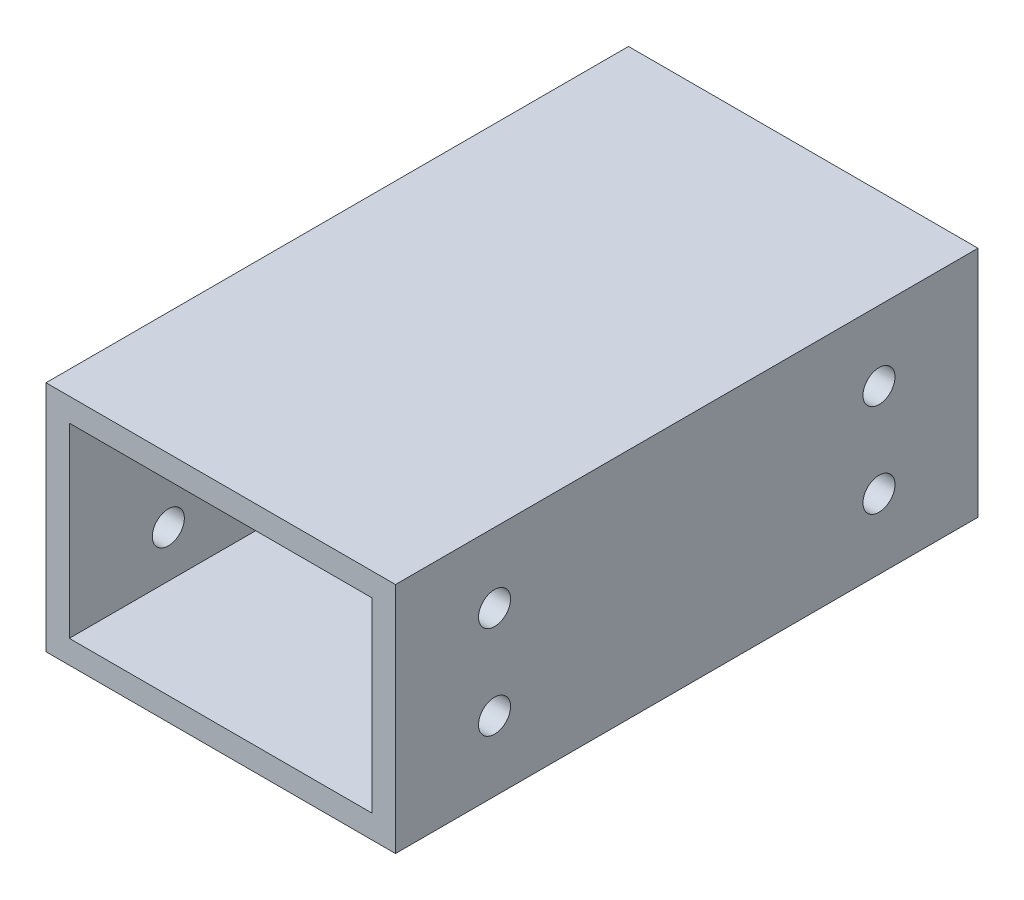
ISO-10303-21;
HEADER;
FILE_DESCRIPTION(('STEP AP214'),'2;1');
FILE_NAME('part.step','',(''),(''),'','','');
FILE_SCHEMA(('AUTOMOTIVE_DESIGN { 1 0 10303 214 1 1 1 1 }'));
ENDSEC;
DATA;
#1=APPLICATION_CONTEXT('core data for automotive mechanical design processes');
#2=APPLICATION_PROTOCOL_DEFINITION('international standard','automotive_design',2000,#1);
#3=PRODUCT_CONTEXT('',#1,'mechanical');
#4=PRODUCT('Part','Part','',(#3));
#5=PRODUCT_RELATED_PRODUCT_CATEGORY('part','',(#4));
#6=PRODUCT_DEFINITION_FORMATION('','',#4);
#7=PRODUCT_DEFINITION_CONTEXT('part definition',#1,'design');
#8=PRODUCT_DEFINITION('design','',#6,#7);
#9=PRODUCT_DEFINITION_SHAPE('','',#8);
#10=(LENGTH_UNIT() NAMED_UNIT(*) SI_UNIT(.MILLI.,.METRE.));
#11=(NAMED_UNIT(*) PLANE_ANGLE_UNIT() SI_UNIT($,.RADIAN.));
#12=(NAMED_UNIT(*) SI_UNIT($,.STERADIAN.) SOLID_ANGLE_UNIT());
#13=UNCERTAINTY_MEASURE_WITH_UNIT(LENGTH_MEASURE(1.E-05),#10,'distance_accuracy_value','');
#14=(GEOMETRIC_REPRESENTATION_CONTEXT(3) GLOBAL_UNCERTAINTY_ASSIGNED_CONTEXT((#13)) GLOBAL_UNIT_ASSIGNED_CONTEXT((#10,
#11,#12)) REPRESENTATION_CONTEXT('',''));
#15=CARTESIAN_POINT('',(0.,0.,0.));
#16=DIRECTION('',(0.,0.,1.));
#17=DIRECTION('',(1.,0.,0.));
#18=AXIS2_PLACEMENT_3D('',#15,#16,#17);
#19=CARTESIAN_POINT('',(30.,-20.,-50.));
#20=DIRECTION('',(1.,0.,0.));
#21=DIRECTION('',(0.,0.,-1.));
#22=AXIS2_PLACEMENT_3D('',#19,#20,#21);
#23=PLANE('',#22);
#24=CARTESIAN_POINT('',(30.,8.,-33.));
#25=DIRECTION('',(-1.,0.,0.));
#26=DIRECTION('',(0.,0.,1.));
#27=AXIS2_PLACEMENT_3D('',#24,#25,#26);
#28=CIRCLE('',#27,2.74999999999999);
#29=CARTESIAN_POINT('',(30.,8.,-30.25));
#30=VERTEX_POINT('',#29);
#31=EDGE_CURVE('E237',#30,#30,#28,.T.);
#32=ORIENTED_EDGE('',*,*,#31,.T.);
#33=EDGE_LOOP('',(#32));
#34=FACE_BOUND('',#33,.T.);
#35=CARTESIAN_POINT('',(30.,-8.,-33.));
#36=DIRECTION('',(-1.,0.,0.));
#37=DIRECTION('',(0.,0.,1.));
#38=AXIS2_PLACEMENT_3D('',#35,#36,#37);
#39=CIRCLE('',#38,2.74999999999999);
#40=CARTESIAN_POINT('',(30.,-8.,-30.25));
#41=VERTEX_POINT('',#40);
#42=EDGE_CURVE('E180',#41,#41,#39,.T.);
#43=ORIENTED_EDGE('',*,*,#42,.T.);
#44=EDGE_LOOP('',(#43));
#45=FACE_BOUND('',#44,.T.);
#46=CARTESIAN_POINT('',(30.,8.,33.));
#47=DIRECTION('',(-1.,0.,0.));
#48=DIRECTION('',(0.,0.,1.));
#49=AXIS2_PLACEMENT_3D('',#46,#47,#48);
#50=CIRCLE('',#49,2.74999999999999);
#51=CARTESIAN_POINT('',(30.,8.,35.75));
#52=VERTEX_POINT('',#51);
#53=EDGE_CURVE('E176',#52,#52,#50,.T.);
#54=ORIENTED_EDGE('',*,*,#53,.T.);
#55=EDGE_LOOP('',(#54));
#56=FACE_BOUND('',#55,.T.);
#57=CARTESIAN_POINT('',(30.,-8.,33.));
#58=DIRECTION('',(-1.,0.,0.));
#59=DIRECTION('',(0.,0.,1.));
#60=AXIS2_PLACEMENT_3D('',#57,#58,#59);
#61=CIRCLE('',#60,2.74999999999999);
#62=CARTESIAN_POINT('',(30.,-8.,35.75));
#63=VERTEX_POINT('',#62);
#64=EDGE_CURVE('E172',#63,#63,#61,.T.);
#65=ORIENTED_EDGE('',*,*,#64,.T.);
#66=EDGE_LOOP('',(#65));
#67=FACE_BOUND('',#66,.T.);
#68=DIRECTION('',(0.,0.,1.));
#69=VECTOR('',#68,1.);
#70=CARTESIAN_POINT('',(30.,20.,-50.));
#71=LINE('',#70,#69);
#72=CARTESIAN_POINT('',(30.,20.,-50.));
#73=VERTEX_POINT('',#72);
#74=CARTESIAN_POINT('',(30.,20.,50.));
#75=VERTEX_POINT('',#74);
#76=EDGE_CURVE('E163',#73,#75,#71,.T.);
#77=ORIENTED_EDGE('',*,*,#76,.T.);
#78=DIRECTION('',(0.,1.,0.));
#79=VECTOR('',#78,1.);
#80=CARTESIAN_POINT('',(30.,-20.,50.));
#81=LINE('',#80,#79);
#82=CARTESIAN_POINT('',(30.,-20.,50.));
#83=VERTEX_POINT('',#82);
#84=EDGE_CURVE('E131',#83,#75,#81,.T.);
#85=ORIENTED_EDGE('',*,*,#84,.F.);
#86=DIRECTION('',(0.,0.,1.));
#87=VECTOR('',#86,1.);
#88=CARTESIAN_POINT('',(30.,-20.,-50.));
#89=LINE('',#88,#87);
#90=CARTESIAN_POINT('',(30.,-20.,-50.));
#91=VERTEX_POINT('',#90);
#92=EDGE_CURVE('E11',#91,#83,#89,.T.);
#93=ORIENTED_EDGE('',*,*,#92,.F.);
#94=DIRECTION('',(0.,1.,0.));
#95=VECTOR('',#94,1.);
#96=CARTESIAN_POINT('',(30.,-20.,-50.));
#97=LINE('',#96,#95);
#98=EDGE_CURVE('E150',#91,#73,#97,.T.);
#99=ORIENTED_EDGE('',*,*,#98,.T.);
#100=EDGE_LOOP('',(#77,#85,#93,#99));
#101=FACE_BOUND('',#100,.T.);
#102=ADVANCED_FACE('F34',(#34,#45,#56,#67,#101),#23,.T.);
#103=CARTESIAN_POINT('',(-30.,-20.,-50.));
#104=DIRECTION('',(0.,-1.,0.));
#105=DIRECTION('',(0.,0.,-1.));
#106=AXIS2_PLACEMENT_3D('',#103,#104,#105);
#107=PLANE('',#106);
#108=ORIENTED_EDGE('',*,*,#92,.T.);
#109=DIRECTION('',(1.,0.,0.));
#110=VECTOR('',#109,1.);
#111=CARTESIAN_POINT('',(-30.,-20.,50.));
#112=LINE('',#111,#110);
#113=CARTESIAN_POINT('',(-30.,-20.,50.));
#114=VERTEX_POINT('',#113);
#115=EDGE_CURVE('E140',#114,#83,#112,.T.);
#116=ORIENTED_EDGE('',*,*,#115,.F.);
#117=DIRECTION('',(0.,0.,1.));
#118=VECTOR('',#117,1.);
#119=CARTESIAN_POINT('',(-30.,-20.,-50.));
#120=LINE('',#119,#118);
#121=CARTESIAN_POINT('',(-30.,-20.,-50.));
#122=VERTEX_POINT('',#121);
#123=EDGE_CURVE('E42',#122,#114,#120,.T.);
#124=ORIENTED_EDGE('',*,*,#123,.F.);
#125=DIRECTION('',(1.,0.,0.));
#126=VECTOR('',#125,1.);
#127=CARTESIAN_POINT('',(-30.,-20.,-50.));
#128=LINE('',#127,#126);
#129=EDGE_CURVE('E161',#122,#91,#128,.T.);
#130=ORIENTED_EDGE('',*,*,#129,.T.);
#131=EDGE_LOOP('',(#108,#116,#124,#130));
#132=FACE_BOUND('',#131,.T.);
#133=ADVANCED_FACE('F227',(#132),#107,.T.);
#134=CARTESIAN_POINT('',(-30.,-20.,-50.));
#135=DIRECTION('',(-1.,0.,0.));
#136=DIRECTION('',(0.,0.,1.));
#137=AXIS2_PLACEMENT_3D('',#134,#135,#136);
#138=PLANE('',#137);
#139=CARTESIAN_POINT('',(-30.,8.,-33.));
#140=DIRECTION('',(-1.,0.,0.));
#141=DIRECTION('',(0.,0.,1.));
#142=AXIS2_PLACEMENT_3D('',#139,#140,#141);
#143=CIRCLE('',#142,2.74999999999999);
#144=CARTESIAN_POINT('',(-30.,8.,-30.25));
#145=VERTEX_POINT('',#144);
#146=EDGE_CURVE('E356',#145,#145,#143,.T.);
#147=ORIENTED_EDGE('',*,*,#146,.F.);
#148=EDGE_LOOP('',(#147));
#149=FACE_BOUND('',#148,.T.);
#150=CARTESIAN_POINT('',(-30.,-8.,-33.));
#151=DIRECTION('',(-1.,0.,0.));
#152=DIRECTION('',(0.,0.,1.));
#153=AXIS2_PLACEMENT_3D('',#150,#151,#152);
#154=CIRCLE('',#153,2.74999999999999);
#155=CARTESIAN_POINT('',(-30.,-8.,-30.25));
#156=VERTEX_POINT('',#155);
#157=EDGE_CURVE('E187',#156,#156,#154,.T.);
#158=ORIENTED_EDGE('',*,*,#157,.F.);
#159=EDGE_LOOP('',(#158));
#160=FACE_BOUND('',#159,.T.);
#161=CARTESIAN_POINT('',(-30.,8.,33.));
#162=DIRECTION('',(-1.,0.,0.));
#163=DIRECTION('',(0.,0.,1.));
#164=AXIS2_PLACEMENT_3D('',#161,#162,#163);
#165=CIRCLE('',#164,2.74999999999999);
#166=CARTESIAN_POINT('',(-30.,8.,35.75));
#167=VERTEX_POINT('',#166);
#168=EDGE_CURVE('E184',#167,#167,#165,.T.);
#169=ORIENTED_EDGE('',*,*,#168,.F.);
#170=EDGE_LOOP('',(#169));
#171=FACE_BOUND('',#170,.T.);
#172=CARTESIAN_POINT('',(-30.,-8.,33.));
#173=DIRECTION('',(-1.,0.,0.));
#174=DIRECTION('',(0.,0.,1.));
#175=AXIS2_PLACEMENT_3D('',#172,#173,#174);
#176=CIRCLE('',#175,2.74999999999999);
#177=CARTESIAN_POINT('',(-30.,-8.,35.75));
#178=VERTEX_POINT('',#177);
#179=EDGE_CURVE('E202',#178,#178,#176,.T.);
#180=ORIENTED_EDGE('',*,*,#179,.F.);
#181=EDGE_LOOP('',(#180));
#182=FACE_BOUND('',#181,.T.);
#183=ORIENTED_EDGE('',*,*,#123,.T.);
#184=DIRECTION('',(0.,-1.,0.));
#185=VECTOR('',#184,1.);
#186=CARTESIAN_POINT('',(-30.,-20.,50.));
#187=LINE('',#186,#185);
#188=CARTESIAN_POINT('',(-30.,20.,50.));
#189=VERTEX_POINT('',#188);
#190=EDGE_CURVE('E137',#189,#114,#187,.T.);
#191=ORIENTED_EDGE('',*,*,#190,.F.);
#192=DIRECTION('',(0.,0.,1.));
#193=VECTOR('',#192,1.);
#194=CARTESIAN_POINT('',(-30.,20.,-50.));
#195=LINE('',#194,#193);
#196=CARTESIAN_POINT('',(-30.,20.,-50.));
#197=VERTEX_POINT('',#196);
#198=EDGE_CURVE('E166',#197,#189,#195,.T.);
#199=ORIENTED_EDGE('',*,*,#198,.F.);
#200=DIRECTION('',(0.,-1.,0.));
#201=VECTOR('',#200,1.);
#202=CARTESIAN_POINT('',(-30.,-20.,-50.));
#203=LINE('',#202,#201);
#204=EDGE_CURVE('E158',#197,#122,#203,.T.);
#205=ORIENTED_EDGE('',*,*,#204,.T.);
#206=EDGE_LOOP('',(#183,#191,#199,#205));
#207=FACE_BOUND('',#206,.T.);
#208=ADVANCED_FACE('F232',(#149,#160,#171,#182,#207),#138,.T.);
#209=CARTESIAN_POINT('',(-30.,20.,-50.));
#210=DIRECTION('',(0.,1.,0.));
#211=DIRECTION('',(0.,0.,1.));
#212=AXIS2_PLACEMENT_3D('',#209,#210,#211);
#213=PLANE('',#212);
#214=ORIENTED_EDGE('',*,*,#198,.T.);
#215=DIRECTION('',(-1.,0.,0.));
#216=VECTOR('',#215,1.);
#217=CARTESIAN_POINT('',(-30.,20.,50.));
#218=LINE('',#217,#216);
#219=EDGE_CURVE('E134',#75,#189,#218,.T.);
#220=ORIENTED_EDGE('',*,*,#219,.F.);
#221=ORIENTED_EDGE('',*,*,#76,.F.);
#222=DIRECTION('',(-1.,0.,0.));
#223=VECTOR('',#222,1.);
#224=CARTESIAN_POINT('',(-30.,20.,-50.));
#225=LINE('',#224,#223);
#226=EDGE_CURVE('E155',#73,#197,#225,.T.);
#227=ORIENTED_EDGE('',*,*,#226,.T.);
#228=EDGE_LOOP('',(#214,#220,#221,#227));
#229=FACE_BOUND('',#228,.T.);
#230=ADVANCED_FACE('F244',(#229),#213,.T.);
#231=CARTESIAN_POINT('',(0.,0.,-50.));
#232=DIRECTION('',(0.,0.,-1.));
#233=DIRECTION('',(-1.,0.,0.));
#234=AXIS2_PLACEMENT_3D('',#231,#232,#233);
#235=PLANE('',#234);
#236=DIRECTION('',(0.,1.,0.));
#237=VECTOR('',#236,1.);
#238=CARTESIAN_POINT('',(26.,-16.,-50.));
#239=LINE('',#238,#237);
#240=CARTESIAN_POINT('',(26.,-16.,-50.));
#241=VERTEX_POINT('',#240);
#242=CARTESIAN_POINT('',(26.,16.,-50.));
#243=VERTEX_POINT('',#242);
#244=EDGE_CURVE('E143',#241,#243,#239,.T.);
#245=ORIENTED_EDGE('',*,*,#244,.T.);
#246=DIRECTION('',(-1.,0.,0.));
#247=VECTOR('',#246,1.);
#248=CARTESIAN_POINT('',(-26.,16.,-50.));
#249=LINE('',#248,#247);
#250=CARTESIAN_POINT('',(-26.,16.,-50.));
#251=VERTEX_POINT('',#250);
#252=EDGE_CURVE('E106',#243,#251,#249,.T.);
#253=ORIENTED_EDGE('',*,*,#252,.T.);
#254=DIRECTION('',(0.,-1.,0.));
#255=VECTOR('',#254,1.);
#256=CARTESIAN_POINT('',(-26.,-16.,-50.));
#257=LINE('',#256,#255);
#258=CARTESIAN_POINT('',(-26.,-16.,-50.));
#259=VERTEX_POINT('',#258);
#260=EDGE_CURVE('E50',#251,#259,#257,.T.);
#261=ORIENTED_EDGE('',*,*,#260,.T.);
#262=DIRECTION('',(1.,0.,0.));
#263=VECTOR('',#262,1.);
#264=CARTESIAN_POINT('',(-26.,-16.,-50.));
#265=LINE('',#264,#263);
#266=EDGE_CURVE('E111',#259,#241,#265,.T.);
#267=ORIENTED_EDGE('',*,*,#266,.T.);
#268=EDGE_LOOP('',(#245,#253,#261,#267));
#269=FACE_BOUND('',#268,.T.);
#270=ORIENTED_EDGE('',*,*,#98,.F.);
#271=ORIENTED_EDGE('',*,*,#129,.F.);
#272=ORIENTED_EDGE('',*,*,#204,.F.);
#273=ORIENTED_EDGE('',*,*,#226,.F.);
#274=EDGE_LOOP('',(#270,#271,#272,#273));
#275=FACE_BOUND('',#274,.T.);
#276=ADVANCED_FACE('F251',(#269,#275),#235,.T.);
#277=CARTESIAN_POINT('',(26.,-16.,-50.));
#278=DIRECTION('',(1.,0.,0.));
#279=DIRECTION('',(0.,0.,-1.));
#280=AXIS2_PLACEMENT_3D('',#277,#278,#279);
#281=PLANE('',#280);
#282=CARTESIAN_POINT('',(26.,8.,-33.));
#283=DIRECTION('',(1.,0.,0.));
#284=DIRECTION('',(0.,0.,-1.));
#285=AXIS2_PLACEMENT_3D('',#282,#283,#284);
#286=CIRCLE('',#285,2.74999999999999);
#287=CARTESIAN_POINT('',(26.,8.,-35.75));
#288=VERTEX_POINT('',#287);
#289=EDGE_CURVE('E192',#288,#288,#286,.T.);
#290=ORIENTED_EDGE('',*,*,#289,.T.);
#291=EDGE_LOOP('',(#290));
#292=FACE_BOUND('',#291,.T.);
#293=CARTESIAN_POINT('',(26.,-8.,-33.));
#294=DIRECTION('',(1.,0.,0.));
#295=DIRECTION('',(0.,0.,-1.));
#296=AXIS2_PLACEMENT_3D('',#293,#294,#295);
#297=CIRCLE('',#296,2.74999999999999);
#298=CARTESIAN_POINT('',(26.,-8.,-35.75));
#299=VERTEX_POINT('',#298);
#300=EDGE_CURVE('E179',#299,#299,#297,.T.);
#301=ORIENTED_EDGE('',*,*,#300,.T.);
#302=EDGE_LOOP('',(#301));
#303=FACE_BOUND('',#302,.T.);
#304=CARTESIAN_POINT('',(26.,8.,33.));
#305=DIRECTION('',(1.,0.,0.));
#306=DIRECTION('',(0.,0.,-1.));
#307=AXIS2_PLACEMENT_3D('',#304,#305,#306);
#308=CIRCLE('',#307,2.74999999999999);
#309=CARTESIAN_POINT('',(26.,8.,30.25));
#310=VERTEX_POINT('',#309);
#311=EDGE_CURVE('E175',#310,#310,#308,.T.);
#312=ORIENTED_EDGE('',*,*,#311,.T.);
#313=EDGE_LOOP('',(#312));
#314=FACE_BOUND('',#313,.T.);
#315=CARTESIAN_POINT('',(26.,-8.,33.));
#316=DIRECTION('',(1.,0.,0.));
#317=DIRECTION('',(0.,0.,-1.));
#318=AXIS2_PLACEMENT_3D('',#315,#316,#317);
#319=CIRCLE('',#318,2.74999999999999);
#320=CARTESIAN_POINT('',(26.,-8.,30.25));
#321=VERTEX_POINT('',#320);
#322=EDGE_CURVE('E120',#321,#321,#319,.T.);
#323=ORIENTED_EDGE('',*,*,#322,.T.);
#324=EDGE_LOOP('',(#323));
#325=FACE_BOUND('',#324,.T.);
#326=DIRECTION('',(0.,0.,1.));
#327=VECTOR('',#326,1.);
#328=CARTESIAN_POINT('',(26.,-16.,-50.));
#329=LINE('',#328,#327);
#330=CARTESIAN_POINT('',(26.,-16.,50.));
#331=VERTEX_POINT('',#330);
#332=EDGE_CURVE('E116',#241,#331,#329,.T.);
#333=ORIENTED_EDGE('',*,*,#332,.T.);
#334=DIRECTION('',(0.,1.,0.));
#335=VECTOR('',#334,1.);
#336=CARTESIAN_POINT('',(26.,-16.,50.));
#337=LINE('',#336,#335);
#338=CARTESIAN_POINT('',(26.,16.,50.));
#339=VERTEX_POINT('',#338);
#340=EDGE_CURVE('E114',#331,#339,#337,.T.);
#341=ORIENTED_EDGE('',*,*,#340,.T.);
#342=DIRECTION('',(0.,0.,1.));
#343=VECTOR('',#342,1.);
#344=CARTESIAN_POINT('',(26.,16.,-50.));
#345=LINE('',#344,#343);
#346=EDGE_CURVE('E99',#243,#339,#345,.T.);
#347=ORIENTED_EDGE('',*,*,#346,.F.);
#348=ORIENTED_EDGE('',*,*,#244,.F.);
#349=EDGE_LOOP('',(#333,#341,#347,#348));
#350=FACE_BOUND('',#349,.T.);
#351=ADVANCED_FACE('F115',(#292,#303,#314,#325,#350),#281,.F.);
#352=CARTESIAN_POINT('',(-26.,-16.,-50.));
#353=DIRECTION('',(0.,-1.,0.));
#354=DIRECTION('',(0.,0.,-1.));
#355=AXIS2_PLACEMENT_3D('',#352,#353,#354);
#356=PLANE('',#355);
#357=DIRECTION('',(0.,0.,1.));
#358=VECTOR('',#357,1.);
#359=CARTESIAN_POINT('',(-26.,-16.,-50.));
#360=LINE('',#359,#358);
#361=CARTESIAN_POINT('',(-26.,-16.,50.));
#362=VERTEX_POINT('',#361);
#363=EDGE_CURVE('E151',#259,#362,#360,.T.);
#364=ORIENTED_EDGE('',*,*,#363,.T.);
#365=DIRECTION('',(1.,0.,0.));
#366=VECTOR('',#365,1.);
#367=CARTESIAN_POINT('',(-26.,-16.,50.));
#368=LINE('',#367,#366);
#369=EDGE_CURVE('E126',#362,#331,#368,.T.);
#370=ORIENTED_EDGE('',*,*,#369,.T.);
#371=ORIENTED_EDGE('',*,*,#332,.F.);
#372=ORIENTED_EDGE('',*,*,#266,.F.);
#373=EDGE_LOOP('',(#364,#370,#371,#372));
#374=FACE_BOUND('',#373,.T.);
#375=ADVANCED_FACE('F267',(#374),#356,.F.);
#376=CARTESIAN_POINT('',(-26.,-16.,-50.));
#377=DIRECTION('',(-1.,0.,0.));
#378=DIRECTION('',(0.,0.,1.));
#379=AXIS2_PLACEMENT_3D('',#376,#377,#378);
#380=PLANE('',#379);
#381=CARTESIAN_POINT('',(-26.,8.,-33.));
#382=DIRECTION('',(-1.,0.,0.));
#383=DIRECTION('',(0.,0.,1.));
#384=AXIS2_PLACEMENT_3D('',#381,#382,#383);
#385=CIRCLE('',#384,2.74999999999999);
#386=CARTESIAN_POINT('',(-26.,8.,-30.25));
#387=VERTEX_POINT('',#386);
#388=EDGE_CURVE('E37',#387,#387,#385,.T.);
#389=ORIENTED_EDGE('',*,*,#388,.T.);
#390=EDGE_LOOP('',(#389));
#391=FACE_BOUND('',#390,.T.);
#392=CARTESIAN_POINT('',(-26.,-8.,-33.));
#393=DIRECTION('',(-1.,0.,0.));
#394=DIRECTION('',(0.,0.,1.));
#395=AXIS2_PLACEMENT_3D('',#392,#393,#394);
#396=CIRCLE('',#395,2.74999999999999);
#397=CARTESIAN_POINT('',(-26.,-8.,-30.25));
#398=VERTEX_POINT('',#397);
#399=EDGE_CURVE('E177',#398,#398,#396,.T.);
#400=ORIENTED_EDGE('',*,*,#399,.T.);
#401=EDGE_LOOP('',(#400));
#402=FACE_BOUND('',#401,.T.);
#403=CARTESIAN_POINT('',(-26.,8.,33.));
#404=DIRECTION('',(-1.,0.,0.));
#405=DIRECTION('',(0.,0.,1.));
#406=AXIS2_PLACEMENT_3D('',#403,#404,#405);
#407=CIRCLE('',#406,2.74999999999999);
#408=CARTESIAN_POINT('',(-26.,8.,35.75));
#409=VERTEX_POINT('',#408);
#410=EDGE_CURVE('E173',#409,#409,#407,.T.);
#411=ORIENTED_EDGE('',*,*,#410,.T.);
#412=EDGE_LOOP('',(#411));
#413=FACE_BOUND('',#412,.T.);
#414=CARTESIAN_POINT('',(-26.,-8.,33.));
#415=DIRECTION('',(-1.,0.,0.));
#416=DIRECTION('',(0.,0.,1.));
#417=AXIS2_PLACEMENT_3D('',#414,#415,#416);
#418=CIRCLE('',#417,2.74999999999999);
#419=CARTESIAN_POINT('',(-26.,-8.,35.75));
#420=VERTEX_POINT('',#419);
#421=EDGE_CURVE('E169',#420,#420,#418,.T.);
#422=ORIENTED_EDGE('',*,*,#421,.T.);
#423=EDGE_LOOP('',(#422));
#424=FACE_BOUND('',#423,.T.);
#425=DIRECTION('',(0.,0.,1.));
#426=VECTOR('',#425,1.);
#427=CARTESIAN_POINT('',(-26.,16.,-50.));
#428=LINE('',#427,#426);
#429=CARTESIAN_POINT('',(-26.,16.,50.));
#430=VERTEX_POINT('',#429);
#431=EDGE_CURVE('E110',#251,#430,#428,.T.);
#432=ORIENTED_EDGE('',*,*,#431,.T.);
#433=DIRECTION('',(0.,-1.,0.));
#434=VECTOR('',#433,1.);
#435=CARTESIAN_POINT('',(-26.,-16.,50.));
#436=LINE('',#435,#434);
#437=EDGE_CURVE('E124',#430,#362,#436,.T.);
#438=ORIENTED_EDGE('',*,*,#437,.T.);
#439=ORIENTED_EDGE('',*,*,#363,.F.);
#440=ORIENTED_EDGE('',*,*,#260,.F.);
#441=EDGE_LOOP('',(#432,#438,#439,#440));
#442=FACE_BOUND('',#441,.T.);
#443=ADVANCED_FACE('F271',(#391,#402,#413,#424,#442),#380,.F.);
#444=CARTESIAN_POINT('',(-26.,16.,-50.));
#445=DIRECTION('',(0.,1.,0.));
#446=DIRECTION('',(0.,0.,1.));
#447=AXIS2_PLACEMENT_3D('',#444,#445,#446);
#448=PLANE('',#447);
#449=ORIENTED_EDGE('',*,*,#346,.T.);
#450=DIRECTION('',(-1.,0.,0.));
#451=VECTOR('',#450,1.);
#452=CARTESIAN_POINT('',(-26.,16.,50.));
#453=LINE('',#452,#451);
#454=EDGE_CURVE('E103',#339,#430,#453,.T.);
#455=ORIENTED_EDGE('',*,*,#454,.T.);
#456=ORIENTED_EDGE('',*,*,#431,.F.);
#457=ORIENTED_EDGE('',*,*,#252,.F.);
#458=EDGE_LOOP('',(#449,#455,#456,#457));
#459=FACE_BOUND('',#458,.T.);
#460=ADVANCED_FACE('F101',(#459),#448,.F.);
#461=CARTESIAN_POINT('',(0.,0.,50.));
#462=DIRECTION('',(0.,0.,-1.));
#463=DIRECTION('',(-1.,0.,0.));
#464=AXIS2_PLACEMENT_3D('',#461,#462,#463);
#465=PLANE('',#464);
#466=ORIENTED_EDGE('',*,*,#84,.T.);
#467=ORIENTED_EDGE('',*,*,#219,.T.);
#468=ORIENTED_EDGE('',*,*,#190,.T.);
#469=ORIENTED_EDGE('',*,*,#115,.T.);
#470=EDGE_LOOP('',(#466,#467,#468,#469));
#471=FACE_BOUND('',#470,.T.);
#472=ORIENTED_EDGE('',*,*,#340,.F.);
#473=ORIENTED_EDGE('',*,*,#369,.F.);
#474=ORIENTED_EDGE('',*,*,#437,.F.);
#475=ORIENTED_EDGE('',*,*,#454,.F.);
#476=EDGE_LOOP('',(#472,#473,#474,#475));
#477=FACE_BOUND('',#476,.T.);
#478=ADVANCED_FACE('F122',(#471,#477),#465,.F.);
#479=CARTESIAN_POINT('',(-30.,-8.,33.));
#480=DIRECTION('',(-1.,0.,0.));
#481=DIRECTION('',(0.,0.,1.));
#482=AXIS2_PLACEMENT_3D('',#479,#480,#481);
#483=CYLINDRICAL_SURFACE('',#482,2.74999999999999);
#484=ORIENTED_EDGE('',*,*,#179,.T.);
#485=EDGE_LOOP('',(#484));
#486=FACE_BOUND('',#485,.T.);
#487=ORIENTED_EDGE('',*,*,#421,.F.);
#488=EDGE_LOOP('',(#487));
#489=FACE_BOUND('',#488,.T.);
#490=ADVANCED_FACE('F213',(#486,#489),#483,.F.);
#491=ORIENTED_EDGE('',*,*,#64,.F.);
#492=EDGE_LOOP('',(#491));
#493=FACE_BOUND('',#492,.T.);
#494=ORIENTED_EDGE('',*,*,#322,.F.);
#495=EDGE_LOOP('',(#494));
#496=FACE_BOUND('',#495,.T.);
#497=ADVANCED_FACE('F210',(#493,#496),#483,.F.);
#498=CARTESIAN_POINT('',(-30.,8.,33.));
#499=DIRECTION('',(-1.,0.,0.));
#500=DIRECTION('',(0.,0.,1.));
#501=AXIS2_PLACEMENT_3D('',#498,#499,#500);
#502=CYLINDRICAL_SURFACE('',#501,2.74999999999999);
#503=ORIENTED_EDGE('',*,*,#168,.T.);
#504=EDGE_LOOP('',(#503));
#505=FACE_BOUND('',#504,.T.);
#506=ORIENTED_EDGE('',*,*,#410,.F.);
#507=EDGE_LOOP('',(#506));
#508=FACE_BOUND('',#507,.T.);
#509=ADVANCED_FACE('F212',(#505,#508),#502,.F.);
#510=ORIENTED_EDGE('',*,*,#53,.F.);
#511=EDGE_LOOP('',(#510));
#512=FACE_BOUND('',#511,.T.);
#513=ORIENTED_EDGE('',*,*,#311,.F.);
#514=EDGE_LOOP('',(#513));
#515=FACE_BOUND('',#514,.T.);
#516=ADVANCED_FACE('F220',(#512,#515),#502,.F.);
#517=CARTESIAN_POINT('',(-30.,-8.,-33.));
#518=DIRECTION('',(-1.,0.,0.));
#519=DIRECTION('',(0.,0.,1.));
#520=AXIS2_PLACEMENT_3D('',#517,#518,#519);
#521=CYLINDRICAL_SURFACE('',#520,2.74999999999999);
#522=ORIENTED_EDGE('',*,*,#157,.T.);
#523=EDGE_LOOP('',(#522));
#524=FACE_BOUND('',#523,.T.);
#525=ORIENTED_EDGE('',*,*,#399,.F.);
#526=EDGE_LOOP('',(#525));
#527=FACE_BOUND('',#526,.T.);
#528=ADVANCED_FACE('F309',(#524,#527),#521,.F.);
#529=ORIENTED_EDGE('',*,*,#42,.F.);
#530=EDGE_LOOP('',(#529));
#531=FACE_BOUND('',#530,.T.);
#532=ORIENTED_EDGE('',*,*,#300,.F.);
#533=EDGE_LOOP('',(#532));
#534=FACE_BOUND('',#533,.T.);
#535=ADVANCED_FACE('F318',(#531,#534),#521,.F.);
#536=CARTESIAN_POINT('',(-30.,8.,-33.));
#537=DIRECTION('',(-1.,0.,0.));
#538=DIRECTION('',(0.,0.,1.));
#539=AXIS2_PLACEMENT_3D('',#536,#537,#538);
#540=CYLINDRICAL_SURFACE('',#539,2.74999999999999);
#541=ORIENTED_EDGE('',*,*,#146,.T.);
#542=EDGE_LOOP('',(#541));
#543=FACE_BOUND('',#542,.T.);
#544=ORIENTED_EDGE('',*,*,#388,.F.);
#545=EDGE_LOOP('',(#544));
#546=FACE_BOUND('',#545,.T.);
#547=ADVANCED_FACE('F328',(#543,#546),#540,.F.);
#548=ORIENTED_EDGE('',*,*,#31,.F.);
#549=EDGE_LOOP('',(#548));
#550=FACE_BOUND('',#549,.T.);
#551=ORIENTED_EDGE('',*,*,#289,.F.);
#552=EDGE_LOOP('',(#551));
#553=FACE_BOUND('',#552,.T.);
#554=ADVANCED_FACE('F337',(#550,#553),#540,.F.);
#555=CLOSED_SHELL('',(#102,#133,#208,#230,#276,#351,#375,#443,#460,#478,#490,#497,#509,#516,
#528,#535,#547,#554));
#556=MANIFOLD_SOLID_BREP('B2',#555);
#557=ADVANCED_BREP_SHAPE_REPRESENTATION('',(#18,#556),#14);
#558=SHAPE_DEFINITION_REPRESENTATION(#9,#557);
ENDSEC;
END-ISO-10303-21;
